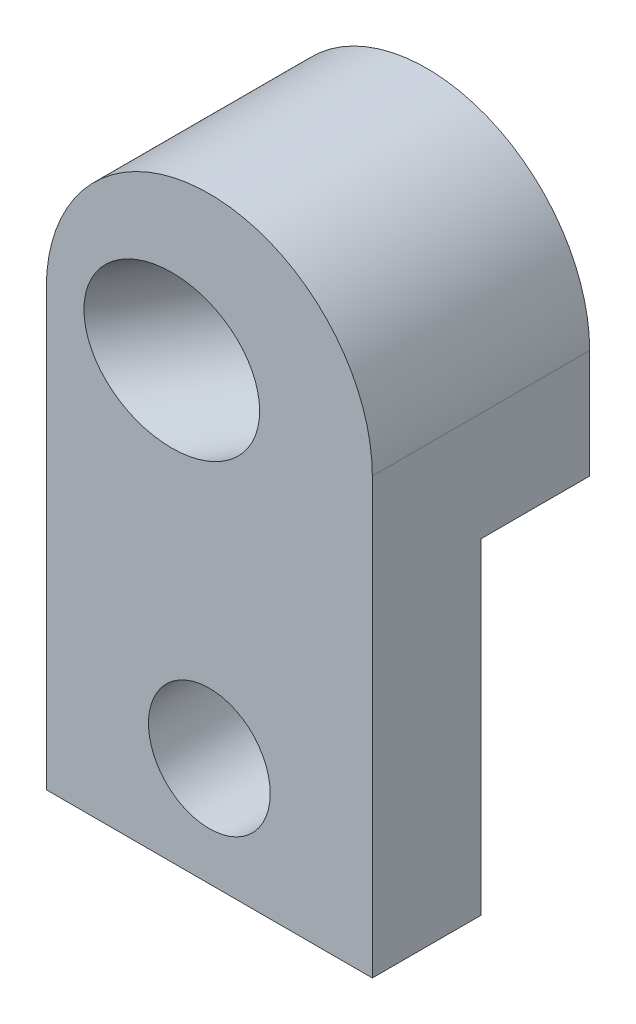
ISO-10303-21;
HEADER;
FILE_DESCRIPTION(('STEP AP214'),'2;1');
FILE_NAME('part.step','',(''),(''),'','','');
FILE_SCHEMA(('AUTOMOTIVE_DESIGN { 1 0 10303 214 1 1 1 1 }'));
ENDSEC;
DATA;
#1=APPLICATION_CONTEXT('core data for automotive mechanical design processes');
#2=APPLICATION_PROTOCOL_DEFINITION('international standard','automotive_design',2000,#1);
#3=PRODUCT_CONTEXT('',#1,'mechanical');
#4=PRODUCT('Part','Part','',(#3));
#5=PRODUCT_RELATED_PRODUCT_CATEGORY('part','',(#4));
#6=PRODUCT_DEFINITION_FORMATION('','',#4);
#7=PRODUCT_DEFINITION_CONTEXT('part definition',#1,'design');
#8=PRODUCT_DEFINITION('design','',#6,#7);
#9=PRODUCT_DEFINITION_SHAPE('','',#8);
#10=(LENGTH_UNIT() NAMED_UNIT(*) SI_UNIT(.MILLI.,.METRE.));
#11=(NAMED_UNIT(*) PLANE_ANGLE_UNIT() SI_UNIT($,.RADIAN.));
#12=(NAMED_UNIT(*) SI_UNIT($,.STERADIAN.) SOLID_ANGLE_UNIT());
#13=UNCERTAINTY_MEASURE_WITH_UNIT(LENGTH_MEASURE(1.E-05),#10,'distance_accuracy_value','');
#14=(GEOMETRIC_REPRESENTATION_CONTEXT(3) GLOBAL_UNCERTAINTY_ASSIGNED_CONTEXT((#13)) GLOBAL_UNIT_ASSIGNED_CONTEXT((#10,
#11,#12)) REPRESENTATION_CONTEXT('',''));
#15=CARTESIAN_POINT('',(0.,0.,0.));
#16=DIRECTION('',(0.,0.,1.));
#17=DIRECTION('',(1.,0.,0.));
#18=AXIS2_PLACEMENT_3D('',#15,#16,#17);
#19=CARTESIAN_POINT('',(7.5,20.,0.));
#20=DIRECTION('',(0.,0.,1.));
#21=DIRECTION('',(1.,0.,0.));
#22=AXIS2_PLACEMENT_3D('',#19,#20,#21);
#23=PLANE('',#22);
#24=CARTESIAN_POINT('',(7.5,5.,0.));
#25=DIRECTION('',(0.,0.,1.));
#26=DIRECTION('',(1.,0.,0.));
#27=AXIS2_PLACEMENT_3D('',#24,#25,#26);
#28=CIRCLE('',#27,2.8);
#29=CARTESIAN_POINT('',(10.3,5.,0.));
#30=VERTEX_POINT('',#29);
#31=EDGE_CURVE('E139',#30,#30,#28,.T.);
#32=ORIENTED_EDGE('',*,*,#31,.T.);
#33=EDGE_LOOP('',(#32));
#34=FACE_BOUND('',#33,.T.);
#35=DIRECTION('',(-1.,0.,0.));
#36=VECTOR('',#35,1.);
#37=CARTESIAN_POINT('',(15.,15.,0.));
#38=LINE('',#37,#36);
#39=CARTESIAN_POINT('',(15.,15.,0.));
#40=VERTEX_POINT('',#39);
#41=CARTESIAN_POINT('',(0.,15.,0.));
#42=VERTEX_POINT('',#41);
#43=EDGE_CURVE('E50',#40,#42,#38,.T.);
#44=ORIENTED_EDGE('',*,*,#43,.F.);
#45=DIRECTION('',(0.,1.,0.));
#46=VECTOR('',#45,1.);
#47=CARTESIAN_POINT('',(15.,0.,0.));
#48=LINE('',#47,#46);
#49=CARTESIAN_POINT('',(15.,0.,0.));
#50=VERTEX_POINT('',#49);
#51=EDGE_CURVE('E132',#50,#40,#48,.T.);
#52=ORIENTED_EDGE('',*,*,#51,.F.);
#53=DIRECTION('',(1.,0.,0.));
#54=VECTOR('',#53,1.);
#55=CARTESIAN_POINT('',(0.,0.,0.));
#56=LINE('',#55,#54);
#57=CARTESIAN_POINT('',(0.,0.,0.));
#58=VERTEX_POINT('',#57);
#59=EDGE_CURVE('E74',#58,#50,#56,.T.);
#60=ORIENTED_EDGE('',*,*,#59,.F.);
#61=DIRECTION('',(0.,-1.,0.));
#62=VECTOR('',#61,1.);
#63=CARTESIAN_POINT('',(0.,20.,0.));
#64=LINE('',#63,#62);
#65=EDGE_CURVE('E146',#42,#58,#64,.T.);
#66=ORIENTED_EDGE('',*,*,#65,.F.);
#67=EDGE_LOOP('',(#44,#52,#60,#66));
#68=FACE_BOUND('',#67,.T.);
#69=ADVANCED_FACE('F33',(#34,#68),#23,.F.);
#70=CARTESIAN_POINT('',(7.5,20.,5.));
#71=DIRECTION('',(0.,0.,1.));
#72=DIRECTION('',(1.,0.,0.));
#73=AXIS2_PLACEMENT_3D('',#70,#71,#72);
#74=PLANE('',#73);
#75=CARTESIAN_POINT('',(5.77350269189626,20.,5.));
#76=DIRECTION('',(0.,0.,1.));
#77=DIRECTION('',(-1.,0.,0.));
#78=AXIS2_PLACEMENT_3D('',#75,#76,#77);
#79=ELLIPSE('',#78,4.04145188432738,3.5);
#80=CARTESIAN_POINT('',(1.73205080756888,20.,5.));
#81=VERTEX_POINT('',#80);
#82=EDGE_CURVE('E37',#81,#81,#79,.T.);
#83=ORIENTED_EDGE('',*,*,#82,.F.);
#84=EDGE_LOOP('',(#83));
#85=FACE_BOUND('',#84,.T.);
#86=DIRECTION('',(0.,-1.,0.));
#87=VECTOR('',#86,1.);
#88=CARTESIAN_POINT('',(0.,20.,5.));
#89=LINE('',#88,#87);
#90=CARTESIAN_POINT('',(0.,20.,5.));
#91=VERTEX_POINT('',#90);
#92=CARTESIAN_POINT('',(0.,0.,5.));
#93=VERTEX_POINT('',#92);
#94=EDGE_CURVE('E148',#91,#93,#89,.T.);
#95=ORIENTED_EDGE('',*,*,#94,.T.);
#96=DIRECTION('',(1.,0.,0.));
#97=VECTOR('',#96,1.);
#98=CARTESIAN_POINT('',(0.,0.,5.));
#99=LINE('',#98,#97);
#100=CARTESIAN_POINT('',(15.,0.,5.));
#101=VERTEX_POINT('',#100);
#102=EDGE_CURVE('E79',#93,#101,#99,.T.);
#103=ORIENTED_EDGE('',*,*,#102,.T.);
#104=DIRECTION('',(0.,1.,0.));
#105=VECTOR('',#104,1.);
#106=CARTESIAN_POINT('',(15.,0.,5.));
#107=LINE('',#106,#105);
#108=CARTESIAN_POINT('',(15.,20.,5.));
#109=VERTEX_POINT('',#108);
#110=EDGE_CURVE('E151',#101,#109,#107,.T.);
#111=ORIENTED_EDGE('',*,*,#110,.T.);
#112=CARTESIAN_POINT('',(7.5,20.,5.));
#113=DIRECTION('',(0.,0.,1.));
#114=DIRECTION('',(1.,0.,0.));
#115=AXIS2_PLACEMENT_3D('',#112,#113,#114);
#116=CIRCLE('',#115,7.5);
#117=EDGE_CURVE('E59',#109,#91,#116,.T.);
#118=ORIENTED_EDGE('',*,*,#117,.T.);
#119=EDGE_LOOP('',(#95,#103,#111,#118));
#120=FACE_BOUND('',#119,.T.);
#121=CARTESIAN_POINT('',(7.5,5.,5.));
#122=DIRECTION('',(0.,0.,1.));
#123=DIRECTION('',(1.,0.,0.));
#124=AXIS2_PLACEMENT_3D('',#121,#122,#123);
#125=CIRCLE('',#124,2.8);
#126=CARTESIAN_POINT('',(10.3,5.,5.));
#127=VERTEX_POINT('',#126);
#128=EDGE_CURVE('E128',#127,#127,#125,.T.);
#129=ORIENTED_EDGE('',*,*,#128,.F.);
#130=EDGE_LOOP('',(#129));
#131=FACE_BOUND('',#130,.T.);
#132=ADVANCED_FACE('F162',(#85,#120,#131),#74,.T.);
#133=CARTESIAN_POINT('',(0.,20.,5.));
#134=DIRECTION('',(1.,0.,0.));
#135=DIRECTION('',(0.,1.,0.));
#136=AXIS2_PLACEMENT_3D('',#133,#134,#135);
#137=PLANE('',#136);
#138=DIRECTION('',(0.,0.,-1.));
#139=VECTOR('',#138,1.);
#140=CARTESIAN_POINT('',(0.,20.,5.));
#141=LINE('',#140,#139);
#142=CARTESIAN_POINT('',(0.,20.,-5.));
#143=VERTEX_POINT('',#142);
#144=EDGE_CURVE('E103',#91,#143,#141,.T.);
#145=ORIENTED_EDGE('',*,*,#144,.T.);
#146=DIRECTION('',(0.,1.,0.));
#147=VECTOR('',#146,1.);
#148=CARTESIAN_POINT('',(0.,15.,-5.));
#149=LINE('',#148,#147);
#150=CARTESIAN_POINT('',(0.,15.,-5.));
#151=VERTEX_POINT('',#150);
#152=EDGE_CURVE('E117',#151,#143,#149,.T.);
#153=ORIENTED_EDGE('',*,*,#152,.F.);
#154=DIRECTION('',(0.,0.,1.));
#155=VECTOR('',#154,1.);
#156=CARTESIAN_POINT('',(0.,15.,-5.));
#157=LINE('',#156,#155);
#158=EDGE_CURVE('E125',#151,#42,#157,.T.);
#159=ORIENTED_EDGE('',*,*,#158,.T.);
#160=ORIENTED_EDGE('',*,*,#65,.T.);
#161=DIRECTION('',(0.,0.,-1.));
#162=VECTOR('',#161,1.);
#163=CARTESIAN_POINT('',(0.,0.,5.));
#164=LINE('',#163,#162);
#165=EDGE_CURVE('E11',#93,#58,#164,.T.);
#166=ORIENTED_EDGE('',*,*,#165,.F.);
#167=ORIENTED_EDGE('',*,*,#94,.F.);
#168=EDGE_LOOP('',(#145,#153,#159,#160,#166,#167));
#169=FACE_BOUND('',#168,.T.);
#170=ADVANCED_FACE('F35',(#169),#137,.F.);
#171=CARTESIAN_POINT('',(0.,0.,5.));
#172=DIRECTION('',(0.,1.,0.));
#173=DIRECTION('',(-1.,0.,0.));
#174=AXIS2_PLACEMENT_3D('',#171,#172,#173);
#175=PLANE('',#174);
#176=ORIENTED_EDGE('',*,*,#59,.T.);
#177=DIRECTION('',(0.,0.,-1.));
#178=VECTOR('',#177,1.);
#179=CARTESIAN_POINT('',(15.,0.,5.));
#180=LINE('',#179,#178);
#181=EDGE_CURVE('E42',#101,#50,#180,.T.);
#182=ORIENTED_EDGE('',*,*,#181,.F.);
#183=ORIENTED_EDGE('',*,*,#102,.F.);
#184=ORIENTED_EDGE('',*,*,#165,.T.);
#185=EDGE_LOOP('',(#176,#182,#183,#184));
#186=FACE_BOUND('',#185,.T.);
#187=ADVANCED_FACE('F164',(#186),#175,.F.);
#188=CARTESIAN_POINT('',(15.,0.,5.));
#189=DIRECTION('',(-1.,0.,0.));
#190=DIRECTION('',(0.,-1.,0.));
#191=AXIS2_PLACEMENT_3D('',#188,#189,#190);
#192=PLANE('',#191);
#193=ORIENTED_EDGE('',*,*,#51,.T.);
#194=DIRECTION('',(0.,0.,1.));
#195=VECTOR('',#194,1.);
#196=CARTESIAN_POINT('',(15.,15.,-5.));
#197=LINE('',#196,#195);
#198=CARTESIAN_POINT('',(15.,15.,-5.));
#199=VERTEX_POINT('',#198);
#200=EDGE_CURVE('E109',#199,#40,#197,.T.);
#201=ORIENTED_EDGE('',*,*,#200,.F.);
#202=DIRECTION('',(0.,-1.,0.));
#203=VECTOR('',#202,1.);
#204=CARTESIAN_POINT('',(15.,20.,-5.));
#205=LINE('',#204,#203);
#206=CARTESIAN_POINT('',(15.,20.,-5.));
#207=VERTEX_POINT('',#206);
#208=EDGE_CURVE('E106',#207,#199,#205,.T.);
#209=ORIENTED_EDGE('',*,*,#208,.F.);
#210=DIRECTION('',(0.,0.,-1.));
#211=VECTOR('',#210,1.);
#212=CARTESIAN_POINT('',(15.,20.,5.));
#213=LINE('',#212,#211);
#214=EDGE_CURVE('E96',#109,#207,#213,.T.);
#215=ORIENTED_EDGE('',*,*,#214,.F.);
#216=ORIENTED_EDGE('',*,*,#110,.F.);
#217=ORIENTED_EDGE('',*,*,#181,.T.);
#218=EDGE_LOOP('',(#193,#201,#209,#215,#216,#217));
#219=FACE_BOUND('',#218,.T.);
#220=ADVANCED_FACE('F107',(#219),#192,.F.);
#221=CARTESIAN_POINT('',(7.5,20.,5.));
#222=DIRECTION('',(0.,0.,-1.));
#223=DIRECTION('',(-1.,0.,0.));
#224=AXIS2_PLACEMENT_3D('',#221,#222,#223);
#225=CYLINDRICAL_SURFACE('',#224,7.5);
#226=ORIENTED_EDGE('',*,*,#214,.T.);
#227=CARTESIAN_POINT('',(7.5,20.,-5.));
#228=DIRECTION('',(0.,0.,-1.));
#229=DIRECTION('',(-1.,0.,0.));
#230=AXIS2_PLACEMENT_3D('',#227,#228,#229);
#231=CIRCLE('',#230,7.5);
#232=EDGE_CURVE('E100',#143,#207,#231,.T.);
#233=ORIENTED_EDGE('',*,*,#232,.F.);
#234=ORIENTED_EDGE('',*,*,#144,.F.);
#235=ORIENTED_EDGE('',*,*,#117,.F.);
#236=EDGE_LOOP('',(#226,#233,#234,#235));
#237=FACE_BOUND('',#236,.T.);
#238=ADVANCED_FACE('F98',(#237),#225,.T.);
#239=CARTESIAN_POINT('',(7.5,5.,5.));
#240=DIRECTION('',(0.,0.,-1.));
#241=DIRECTION('',(-1.,0.,0.));
#242=AXIS2_PLACEMENT_3D('',#239,#240,#241);
#243=CYLINDRICAL_SURFACE('',#242,2.8);
#244=ORIENTED_EDGE('',*,*,#128,.T.);
#245=EDGE_LOOP('',(#244));
#246=FACE_BOUND('',#245,.T.);
#247=ORIENTED_EDGE('',*,*,#31,.F.);
#248=EDGE_LOOP('',(#247));
#249=FACE_BOUND('',#248,.T.);
#250=ADVANCED_FACE('F168',(#246,#249),#243,.F.);
#251=CARTESIAN_POINT('',(15.,15.,-5.));
#252=DIRECTION('',(0.,1.,0.));
#253=DIRECTION('',(0.,0.,1.));
#254=AXIS2_PLACEMENT_3D('',#251,#252,#253);
#255=PLANE('',#254);
#256=ORIENTED_EDGE('',*,*,#43,.T.);
#257=ORIENTED_EDGE('',*,*,#158,.F.);
#258=DIRECTION('',(-1.,0.,0.));
#259=VECTOR('',#258,1.);
#260=CARTESIAN_POINT('',(15.,15.,-5.));
#261=LINE('',#260,#259);
#262=EDGE_CURVE('E112',#199,#151,#261,.T.);
#263=ORIENTED_EDGE('',*,*,#262,.F.);
#264=ORIENTED_EDGE('',*,*,#200,.T.);
#265=EDGE_LOOP('',(#256,#257,#263,#264));
#266=FACE_BOUND('',#265,.T.);
#267=ADVANCED_FACE('F166',(#266),#255,.F.);
#268=CARTESIAN_POINT('',(7.5,20.,-5.));
#269=DIRECTION('',(0.,0.,-1.));
#270=DIRECTION('',(-1.,0.,0.));
#271=AXIS2_PLACEMENT_3D('',#268,#269,#270);
#272=PLANE('',#271);
#273=ORIENTED_EDGE('',*,*,#232,.T.);
#274=ORIENTED_EDGE('',*,*,#208,.T.);
#275=ORIENTED_EDGE('',*,*,#262,.T.);
#276=ORIENTED_EDGE('',*,*,#152,.T.);
#277=EDGE_LOOP('',(#273,#274,#275,#276));
#278=FACE_BOUND('',#277,.T.);
#279=ADVANCED_FACE('F115',(#278),#272,.T.);
#280=CARTESIAN_POINT('',(9.3301270189222,20.,-1.16025403784438));
#281=DIRECTION('',(-0.500000000000001,0.,0.866025403784438));
#282=DIRECTION('',(0.866025403784438,0.,0.500000000000001));
#283=AXIS2_PLACEMENT_3D('',#280,#281,#282);
#284=CYLINDRICAL_SURFACE('',#283,3.5);
#285=ORIENTED_EDGE('',*,*,#82,.T.);
#286=EDGE_LOOP('',(#285));
#287=FACE_BOUND('',#286,.T.);
#288=CARTESIAN_POINT('',(9.3301270189222,20.,-1.16025403784438));
#289=DIRECTION('',(-0.500000000000001,0.,0.866025403784438));
#290=DIRECTION('',(0.866025403784438,0.,0.500000000000001));
#291=AXIS2_PLACEMENT_3D('',#288,#289,#290);
#292=CIRCLE('',#291,3.5);
#293=CARTESIAN_POINT('',(12.3612159321677,20.,0.589745962155627));
#294=VERTEX_POINT('',#293);
#295=EDGE_CURVE('E121',#294,#294,#292,.T.);
#296=ORIENTED_EDGE('',*,*,#295,.F.);
#297=EDGE_LOOP('',(#296));
#298=FACE_BOUND('',#297,.T.);
#299=ADVANCED_FACE('F174',(#287,#298),#284,.F.);
#300=CARTESIAN_POINT('',(9.3301270189222,20.,-1.16025403784438));
#301=DIRECTION('',(-0.500000000000001,0.,0.866025403784438));
#302=DIRECTION('',(0.866025403784438,0.,0.500000000000001));
#303=AXIS2_PLACEMENT_3D('',#300,#301,#302);
#304=PLANE('',#303);
#305=ORIENTED_EDGE('',*,*,#295,.T.);
#306=EDGE_LOOP('',(#305));
#307=FACE_BOUND('',#306,.T.);
#308=ADVANCED_FACE('F213',(#307),#304,.T.);
#309=CLOSED_SHELL('',(#69,#132,#170,#187,#220,#238,#250,#267,#279,#299,#308));
#310=MANIFOLD_SOLID_BREP('B2',#309);
#311=ADVANCED_BREP_SHAPE_REPRESENTATION('',(#18,#310),#14);
#312=SHAPE_DEFINITION_REPRESENTATION(#9,#311);
ENDSEC;
END-ISO-10303-21;
